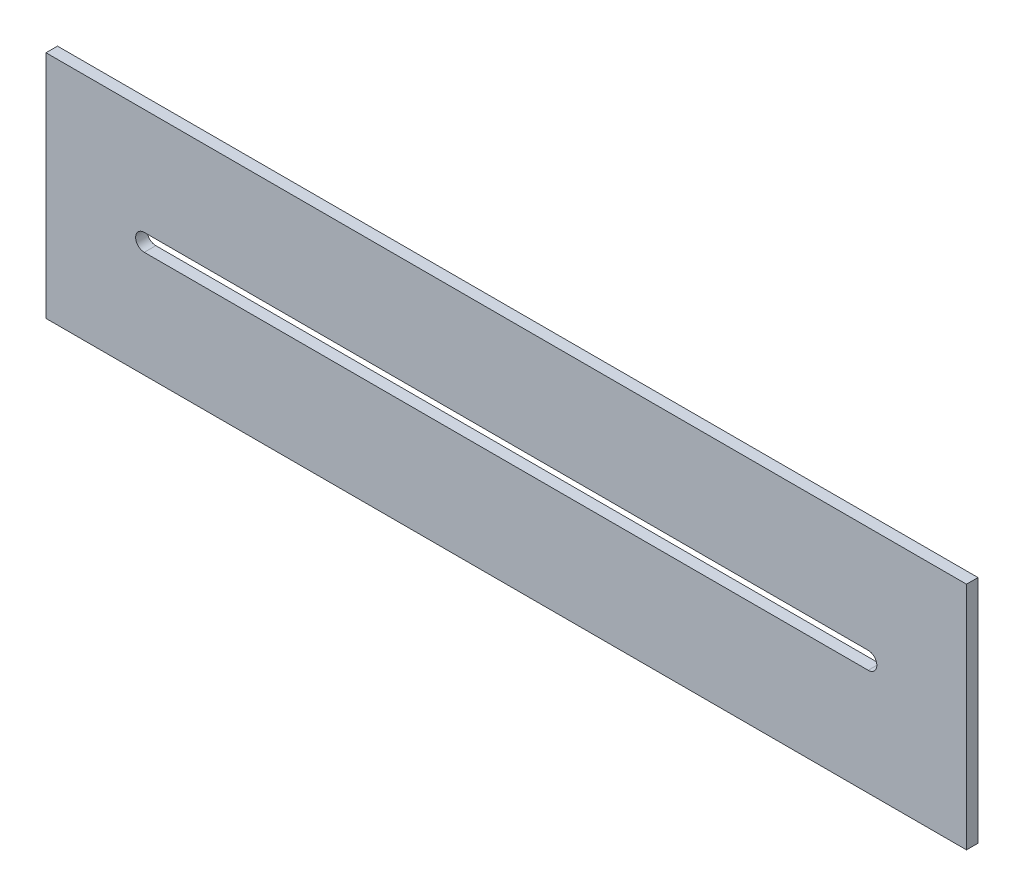
ISO-10303-21;
HEADER;
FILE_DESCRIPTION(('STEP AP214'),'2;1');
FILE_NAME('part.step','',(''),(''),'','','');
FILE_SCHEMA(('AUTOMOTIVE_DESIGN { 1 0 10303 214 1 1 1 1 }'));
ENDSEC;
DATA;
#1=APPLICATION_CONTEXT('core data for automotive mechanical design processes');
#2=APPLICATION_PROTOCOL_DEFINITION('international standard','automotive_design',2000,#1);
#3=PRODUCT_CONTEXT('',#1,'mechanical');
#4=PRODUCT('Part','Part','',(#3));
#5=PRODUCT_RELATED_PRODUCT_CATEGORY('part','',(#4));
#6=PRODUCT_DEFINITION_FORMATION('','',#4);
#7=PRODUCT_DEFINITION_CONTEXT('part definition',#1,'design');
#8=PRODUCT_DEFINITION('design','',#6,#7);
#9=PRODUCT_DEFINITION_SHAPE('','',#8);
#10=(LENGTH_UNIT() NAMED_UNIT(*) SI_UNIT(.MILLI.,.METRE.));
#11=(NAMED_UNIT(*) PLANE_ANGLE_UNIT() SI_UNIT($,.RADIAN.));
#12=(NAMED_UNIT(*) SI_UNIT($,.STERADIAN.) SOLID_ANGLE_UNIT());
#13=UNCERTAINTY_MEASURE_WITH_UNIT(LENGTH_MEASURE(1.E-05),#10,'distance_accuracy_value','');
#14=(GEOMETRIC_REPRESENTATION_CONTEXT(3) GLOBAL_UNCERTAINTY_ASSIGNED_CONTEXT((#13)) GLOBAL_UNIT_ASSIGNED_CONTEXT((#10,
#11,#12)) REPRESENTATION_CONTEXT('',''));
#15=CARTESIAN_POINT('',(0.,0.,0.));
#16=DIRECTION('',(0.,0.,1.));
#17=DIRECTION('',(1.,0.,0.));
#18=AXIS2_PLACEMENT_3D('',#15,#16,#17);
#19=CARTESIAN_POINT('',(-73.8573710965868,28.8913471314452,108.965999999998));
#20=DIRECTION('',(-1.,0.,0.));
#21=DIRECTION('',(0.,0.,1.));
#22=AXIS2_PLACEMENT_3D('',#19,#20,#21);
#23=PLANE('',#22);
#24=DIRECTION('',(0.,-1.,0.));
#25=VECTOR('',#24,1.);
#26=CARTESIAN_POINT('',(-73.8573710965868,28.8913471314452,111.505999999998));
#27=LINE('',#26,#25);
#28=CARTESIAN_POINT('',(-73.8573710965868,28.8913471314452,111.505999999998));
#29=VERTEX_POINT('',#28);
#30=CARTESIAN_POINT('',(-73.8573710965868,-21.9086528685548,111.505999999998));
#31=VERTEX_POINT('',#30);
#32=EDGE_CURVE('E131',#29,#31,#27,.T.);
#33=ORIENTED_EDGE('',*,*,#32,.F.);
#34=DIRECTION('',(0.,0.,1.));
#35=VECTOR('',#34,1.);
#36=CARTESIAN_POINT('',(-73.8573710965868,28.8913471314452,108.965999999998));
#37=LINE('',#36,#35);
#38=CARTESIAN_POINT('',(-73.8573710965868,28.8913471314452,108.965999999998));
#39=VERTEX_POINT('',#38);
#40=EDGE_CURVE('E11',#39,#29,#37,.T.);
#41=ORIENTED_EDGE('',*,*,#40,.F.);
#42=DIRECTION('',(0.,-1.,0.));
#43=VECTOR('',#42,1.);
#44=CARTESIAN_POINT('',(-73.8573710965868,28.8913471314452,108.965999999998));
#45=LINE('',#44,#43);
#46=CARTESIAN_POINT('',(-73.8573710965868,-21.9086528685548,108.965999999998));
#47=VERTEX_POINT('',#46);
#48=EDGE_CURVE('E135',#39,#47,#45,.T.);
#49=ORIENTED_EDGE('',*,*,#48,.T.);
#50=DIRECTION('',(0.,0.,1.));
#51=VECTOR('',#50,1.);
#52=CARTESIAN_POINT('',(-73.8573710965868,-21.9086528685548,108.965999999998));
#53=LINE('',#52,#51);
#54=EDGE_CURVE('E36',#47,#31,#53,.T.);
#55=ORIENTED_EDGE('',*,*,#54,.T.);
#56=EDGE_LOOP('',(#33,#41,#49,#55));
#57=FACE_BOUND('',#56,.T.);
#58=ADVANCED_FACE('F33',(#57),#23,.T.);
#59=CARTESIAN_POINT('',(-73.8573710965868,28.8913471314452,108.965999999998));
#60=DIRECTION('',(0.,1.,0.));
#61=DIRECTION('',(0.,0.,1.));
#62=AXIS2_PLACEMENT_3D('',#59,#60,#61);
#63=PLANE('',#62);
#64=DIRECTION('',(-1.,0.,0.));
#65=VECTOR('',#64,1.);
#66=CARTESIAN_POINT('',(-73.8573710965868,28.8913471314452,111.505999999998));
#67=LINE('',#66,#65);
#68=CARTESIAN_POINT('',(129.342628903413,28.8913471314452,111.505999999998));
#69=VERTEX_POINT('',#68);
#70=EDGE_CURVE('E139',#69,#29,#67,.T.);
#71=ORIENTED_EDGE('',*,*,#70,.F.);
#72=DIRECTION('',(0.,0.,1.));
#73=VECTOR('',#72,1.);
#74=CARTESIAN_POINT('',(129.342628903413,28.8913471314452,108.965999999998));
#75=LINE('',#74,#73);
#76=CARTESIAN_POINT('',(129.342628903413,28.8913471314452,108.965999999998));
#77=VERTEX_POINT('',#76);
#78=EDGE_CURVE('E41',#77,#69,#75,.T.);
#79=ORIENTED_EDGE('',*,*,#78,.F.);
#80=DIRECTION('',(-1.,0.,0.));
#81=VECTOR('',#80,1.);
#82=CARTESIAN_POINT('',(-73.8573710965868,28.8913471314452,108.965999999998));
#83=LINE('',#82,#81);
#84=EDGE_CURVE('E145',#77,#39,#83,.T.);
#85=ORIENTED_EDGE('',*,*,#84,.T.);
#86=ORIENTED_EDGE('',*,*,#40,.T.);
#87=EDGE_LOOP('',(#71,#79,#85,#86));
#88=FACE_BOUND('',#87,.T.);
#89=ADVANCED_FACE('F171',(#88),#63,.T.);
#90=CARTESIAN_POINT('',(129.342628903413,28.8913471314452,108.965999999998));
#91=DIRECTION('',(1.,0.,0.));
#92=DIRECTION('',(0.,0.,-1.));
#93=AXIS2_PLACEMENT_3D('',#90,#91,#92);
#94=PLANE('',#93);
#95=DIRECTION('',(0.,1.,0.));
#96=VECTOR('',#95,1.);
#97=CARTESIAN_POINT('',(129.342628903413,28.8913471314452,111.505999999998));
#98=LINE('',#97,#96);
#99=CARTESIAN_POINT('',(129.342628903413,-21.9086528685548,111.505999999998));
#100=VERTEX_POINT('',#99);
#101=EDGE_CURVE('E153',#100,#69,#98,.T.);
#102=ORIENTED_EDGE('',*,*,#101,.F.);
#103=DIRECTION('',(0.,0.,1.));
#104=VECTOR('',#103,1.);
#105=CARTESIAN_POINT('',(129.342628903413,-21.9086528685548,108.965999999998));
#106=LINE('',#105,#104);
#107=CARTESIAN_POINT('',(129.342628903413,-21.9086528685548,108.965999999998));
#108=VERTEX_POINT('',#107);
#109=EDGE_CURVE('E158',#108,#100,#106,.T.);
#110=ORIENTED_EDGE('',*,*,#109,.F.);
#111=DIRECTION('',(0.,1.,0.));
#112=VECTOR('',#111,1.);
#113=CARTESIAN_POINT('',(129.342628903413,28.8913471314452,108.965999999998));
#114=LINE('',#113,#112);
#115=EDGE_CURVE('E142',#108,#77,#114,.T.);
#116=ORIENTED_EDGE('',*,*,#115,.T.);
#117=ORIENTED_EDGE('',*,*,#78,.T.);
#118=EDGE_LOOP('',(#102,#110,#116,#117));
#119=FACE_BOUND('',#118,.T.);
#120=ADVANCED_FACE('F175',(#119),#94,.T.);
#121=CARTESIAN_POINT('',(-73.8573710965868,-21.9086528685548,108.965999999998));
#122=DIRECTION('',(0.,-1.,0.));
#123=DIRECTION('',(0.,0.,-1.));
#124=AXIS2_PLACEMENT_3D('',#121,#122,#123);
#125=PLANE('',#124);
#126=DIRECTION('',(1.,0.,0.));
#127=VECTOR('',#126,1.);
#128=CARTESIAN_POINT('',(-73.8573710965868,-21.9086528685548,111.505999999998));
#129=LINE('',#128,#127);
#130=EDGE_CURVE('E150',#31,#100,#129,.T.);
#131=ORIENTED_EDGE('',*,*,#130,.F.);
#132=ORIENTED_EDGE('',*,*,#54,.F.);
#133=DIRECTION('',(1.,0.,0.));
#134=VECTOR('',#133,1.);
#135=CARTESIAN_POINT('',(-73.8573710965868,-21.9086528685548,108.965999999998));
#136=LINE('',#135,#134);
#137=EDGE_CURVE('E138',#47,#108,#136,.T.);
#138=ORIENTED_EDGE('',*,*,#137,.T.);
#139=ORIENTED_EDGE('',*,*,#109,.T.);
#140=EDGE_LOOP('',(#131,#132,#138,#139));
#141=FACE_BOUND('',#140,.T.);
#142=ADVANCED_FACE('F166',(#141),#125,.T.);
#143=CARTESIAN_POINT('',(0.,0.,108.965999999998));
#144=DIRECTION('',(0.,0.,1.));
#145=DIRECTION('',(1.,0.,0.));
#146=AXIS2_PLACEMENT_3D('',#143,#144,#145);
#147=PLANE('',#146);
#148=DIRECTION('',(-1.,0.,0.));
#149=VECTOR('',#148,1.);
#150=CARTESIAN_POINT('',(-52.1649963689179,5.39634713144517,108.965999999998));
#151=LINE('',#150,#149);
#152=CARTESIAN_POINT('',(107.650254175744,5.39634713144517,108.965999999998));
#153=VERTEX_POINT('',#152);
#154=CARTESIAN_POINT('',(-52.1649963689179,5.39634713144517,108.965999999998));
#155=VERTEX_POINT('',#154);
#156=EDGE_CURVE('E106',#153,#155,#151,.T.);
#157=ORIENTED_EDGE('',*,*,#156,.T.);
#158=CARTESIAN_POINT('',(-52.1649963689179,3.49134713144517,108.965999999998));
#159=DIRECTION('',(0.,0.,1.));
#160=DIRECTION('',(1.,0.,0.));
#161=AXIS2_PLACEMENT_3D('',#158,#159,#160);
#162=CIRCLE('',#161,1.905);
#163=CARTESIAN_POINT('',(-52.1649963689179,1.58634713144517,108.965999999998));
#164=VERTEX_POINT('',#163);
#165=EDGE_CURVE('E100',#155,#164,#162,.T.);
#166=ORIENTED_EDGE('',*,*,#165,.T.);
#167=DIRECTION('',(1.,0.,0.));
#168=VECTOR('',#167,1.);
#169=CARTESIAN_POINT('',(-52.1649963689179,1.58634713144517,108.965999999998));
#170=LINE('',#169,#168);
#171=CARTESIAN_POINT('',(107.650254175744,1.58634713144517,108.965999999998));
#172=VERTEX_POINT('',#171);
#173=EDGE_CURVE('E109',#164,#172,#170,.T.);
#174=ORIENTED_EDGE('',*,*,#173,.T.);
#175=CARTESIAN_POINT('',(107.650254175744,3.49134713144517,108.965999999998));
#176=DIRECTION('',(0.,0.,1.));
#177=DIRECTION('',(1.,0.,0.));
#178=AXIS2_PLACEMENT_3D('',#175,#176,#177);
#179=CIRCLE('',#178,1.905);
#180=EDGE_CURVE('E49',#172,#153,#179,.T.);
#181=ORIENTED_EDGE('',*,*,#180,.T.);
#182=EDGE_LOOP('',(#157,#166,#174,#181));
#183=FACE_BOUND('',#182,.T.);
#184=ORIENTED_EDGE('',*,*,#48,.F.);
#185=ORIENTED_EDGE('',*,*,#84,.F.);
#186=ORIENTED_EDGE('',*,*,#115,.F.);
#187=ORIENTED_EDGE('',*,*,#137,.F.);
#188=EDGE_LOOP('',(#184,#185,#186,#187));
#189=FACE_BOUND('',#188,.T.);
#190=ADVANCED_FACE('F113',(#183,#189),#147,.F.);
#191=CARTESIAN_POINT('',(0.,0.,111.505999999998));
#192=DIRECTION('',(0.,0.,1.));
#193=DIRECTION('',(1.,0.,0.));
#194=AXIS2_PLACEMENT_3D('',#191,#192,#193);
#195=PLANE('',#194);
#196=CARTESIAN_POINT('',(-52.1649963689179,3.49134713144517,111.505999999998));
#197=DIRECTION('',(0.,0.,1.));
#198=DIRECTION('',(1.,0.,0.));
#199=AXIS2_PLACEMENT_3D('',#196,#197,#198);
#200=CIRCLE('',#199,1.905);
#201=CARTESIAN_POINT('',(-52.1649963689179,5.39634713144517,111.505999999998));
#202=VERTEX_POINT('',#201);
#203=CARTESIAN_POINT('',(-52.1649963689179,1.58634713144517,111.505999999998));
#204=VERTEX_POINT('',#203);
#205=EDGE_CURVE('E57',#202,#204,#200,.T.);
#206=ORIENTED_EDGE('',*,*,#205,.F.);
#207=DIRECTION('',(-1.,0.,0.));
#208=VECTOR('',#207,1.);
#209=CARTESIAN_POINT('',(-52.1649963689179,5.39634713144517,111.505999999998));
#210=LINE('',#209,#208);
#211=CARTESIAN_POINT('',(107.650254175744,5.39634713144517,111.505999999998));
#212=VERTEX_POINT('',#211);
#213=EDGE_CURVE('E116',#212,#202,#210,.T.);
#214=ORIENTED_EDGE('',*,*,#213,.F.);
#215=CARTESIAN_POINT('',(107.650254175744,3.49134713144517,111.505999999998));
#216=DIRECTION('',(0.,0.,1.));
#217=DIRECTION('',(1.,0.,0.));
#218=AXIS2_PLACEMENT_3D('',#215,#216,#217);
#219=CIRCLE('',#218,1.905);
#220=CARTESIAN_POINT('',(107.650254175744,1.58634713144517,111.505999999998));
#221=VERTEX_POINT('',#220);
#222=EDGE_CURVE('E119',#221,#212,#219,.T.);
#223=ORIENTED_EDGE('',*,*,#222,.F.);
#224=DIRECTION('',(1.,0.,0.));
#225=VECTOR('',#224,1.);
#226=CARTESIAN_POINT('',(-52.1649963689179,1.58634713144517,111.505999999998));
#227=LINE('',#226,#225);
#228=EDGE_CURVE('E125',#204,#221,#227,.T.);
#229=ORIENTED_EDGE('',*,*,#228,.F.);
#230=EDGE_LOOP('',(#206,#214,#223,#229));
#231=FACE_BOUND('',#230,.T.);
#232=ORIENTED_EDGE('',*,*,#32,.T.);
#233=ORIENTED_EDGE('',*,*,#130,.T.);
#234=ORIENTED_EDGE('',*,*,#101,.T.);
#235=ORIENTED_EDGE('',*,*,#70,.T.);
#236=EDGE_LOOP('',(#232,#233,#234,#235));
#237=FACE_BOUND('',#236,.T.);
#238=ADVANCED_FACE('F168',(#231,#237),#195,.T.);
#239=CARTESIAN_POINT('',(-52.1649963689179,3.49134713144517,108.965999999998));
#240=DIRECTION('',(0.,0.,1.));
#241=DIRECTION('',(1.,0.,0.));
#242=AXIS2_PLACEMENT_3D('',#239,#240,#241);
#243=CYLINDRICAL_SURFACE('',#242,1.905);
#244=ORIENTED_EDGE('',*,*,#205,.T.);
#245=DIRECTION('',(0.,0.,1.));
#246=VECTOR('',#245,1.);
#247=CARTESIAN_POINT('',(-52.1649963689179,1.58634713144517,108.965999999998));
#248=LINE('',#247,#246);
#249=EDGE_CURVE('E96',#164,#204,#248,.T.);
#250=ORIENTED_EDGE('',*,*,#249,.F.);
#251=ORIENTED_EDGE('',*,*,#165,.F.);
#252=DIRECTION('',(0.,0.,1.));
#253=VECTOR('',#252,1.);
#254=CARTESIAN_POINT('',(-52.1649963689179,5.39634713144517,108.965999999998));
#255=LINE('',#254,#253);
#256=EDGE_CURVE('E129',#155,#202,#255,.T.);
#257=ORIENTED_EDGE('',*,*,#256,.T.);
#258=EDGE_LOOP('',(#244,#250,#251,#257));
#259=FACE_BOUND('',#258,.T.);
#260=ADVANCED_FACE('F98',(#259),#243,.F.);
#261=CARTESIAN_POINT('',(-52.1649963689179,5.39634713144517,108.965999999998));
#262=DIRECTION('',(0.,1.,0.));
#263=DIRECTION('',(0.,0.,1.));
#264=AXIS2_PLACEMENT_3D('',#261,#262,#263);
#265=PLANE('',#264);
#266=ORIENTED_EDGE('',*,*,#213,.T.);
#267=ORIENTED_EDGE('',*,*,#256,.F.);
#268=ORIENTED_EDGE('',*,*,#156,.F.);
#269=DIRECTION('',(0.,0.,1.));
#270=VECTOR('',#269,1.);
#271=CARTESIAN_POINT('',(107.650254175744,5.39634713144517,108.965999999998));
#272=LINE('',#271,#270);
#273=EDGE_CURVE('E132',#153,#212,#272,.T.);
#274=ORIENTED_EDGE('',*,*,#273,.T.);
#275=EDGE_LOOP('',(#266,#267,#268,#274));
#276=FACE_BOUND('',#275,.T.);
#277=ADVANCED_FACE('F226',(#276),#265,.F.);
#278=CARTESIAN_POINT('',(107.650254175744,3.49134713144517,108.965999999998));
#279=DIRECTION('',(0.,0.,1.));
#280=DIRECTION('',(1.,0.,0.));
#281=AXIS2_PLACEMENT_3D('',#278,#279,#280);
#282=CYLINDRICAL_SURFACE('',#281,1.905);
#283=ORIENTED_EDGE('',*,*,#222,.T.);
#284=ORIENTED_EDGE('',*,*,#273,.F.);
#285=ORIENTED_EDGE('',*,*,#180,.F.);
#286=DIRECTION('',(0.,0.,1.));
#287=VECTOR('',#286,1.);
#288=CARTESIAN_POINT('',(107.650254175744,1.58634713144517,108.965999999998));
#289=LINE('',#288,#287);
#290=EDGE_CURVE('E105',#172,#221,#289,.T.);
#291=ORIENTED_EDGE('',*,*,#290,.T.);
#292=EDGE_LOOP('',(#283,#284,#285,#291));
#293=FACE_BOUND('',#292,.T.);
#294=ADVANCED_FACE('F235',(#293),#282,.F.);
#295=CARTESIAN_POINT('',(-52.1649963689179,1.58634713144517,108.965999999998));
#296=DIRECTION('',(0.,-1.,0.));
#297=DIRECTION('',(0.,0.,-1.));
#298=AXIS2_PLACEMENT_3D('',#295,#296,#297);
#299=PLANE('',#298);
#300=ORIENTED_EDGE('',*,*,#228,.T.);
#301=ORIENTED_EDGE('',*,*,#290,.F.);
#302=ORIENTED_EDGE('',*,*,#173,.F.);
#303=ORIENTED_EDGE('',*,*,#249,.T.);
#304=EDGE_LOOP('',(#300,#301,#302,#303));
#305=FACE_BOUND('',#304,.T.);
#306=ADVANCED_FACE('F110',(#305),#299,.F.);
#307=CLOSED_SHELL('',(#58,#89,#120,#142,#190,#238,#260,#277,#294,#306));
#308=MANIFOLD_SOLID_BREP('B2',#307);
#309=ADVANCED_BREP_SHAPE_REPRESENTATION('',(#18,#308),#14);
#310=SHAPE_DEFINITION_REPRESENTATION(#9,#309);
ENDSEC;
END-ISO-10303-21;
